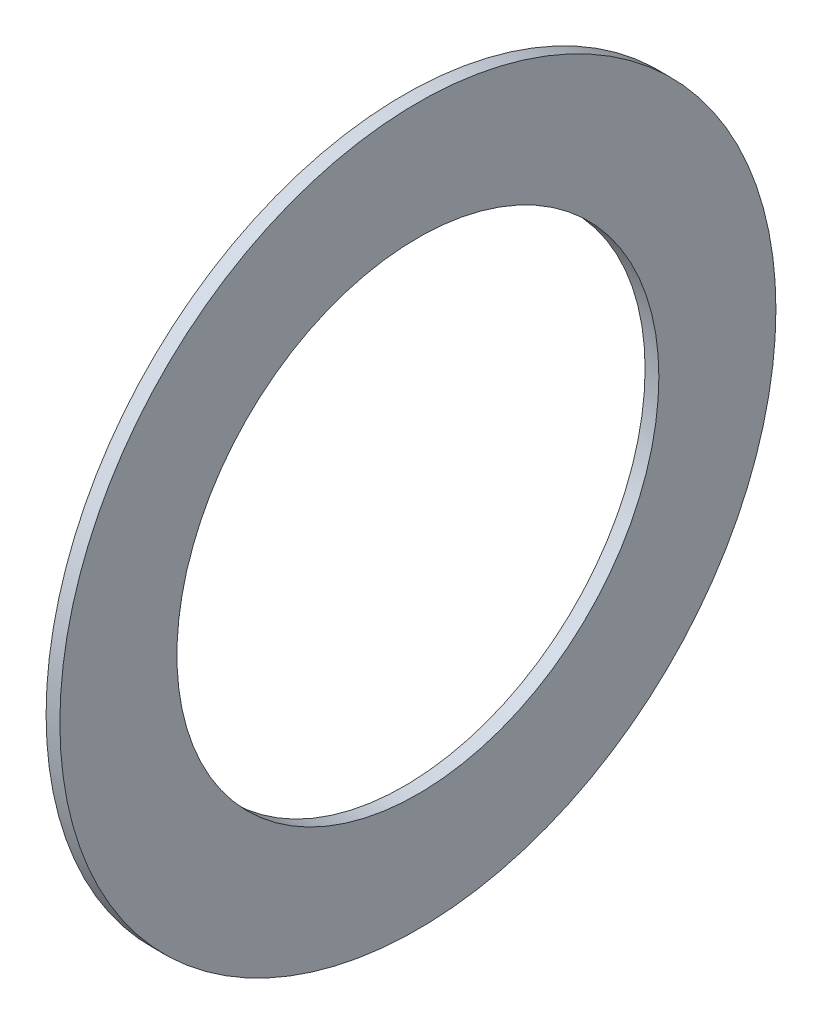
ISO-10303-21;
HEADER;
FILE_DESCRIPTION(('STEP AP214'),'2;1');
FILE_NAME('part.step','',(''),(''),'','','');
FILE_SCHEMA(('AUTOMOTIVE_DESIGN { 1 0 10303 214 1 1 1 1 }'));
ENDSEC;
DATA;
#1=APPLICATION_CONTEXT('core data for automotive mechanical design processes');
#2=APPLICATION_PROTOCOL_DEFINITION('international standard','automotive_design',2000,#1);
#3=PRODUCT_CONTEXT('',#1,'mechanical');
#4=PRODUCT('Part','Part','',(#3));
#5=PRODUCT_RELATED_PRODUCT_CATEGORY('part','',(#4));
#6=PRODUCT_DEFINITION_FORMATION('','',#4);
#7=PRODUCT_DEFINITION_CONTEXT('part definition',#1,'design');
#8=PRODUCT_DEFINITION('design','',#6,#7);
#9=PRODUCT_DEFINITION_SHAPE('','',#8);
#10=(LENGTH_UNIT() NAMED_UNIT(*) SI_UNIT(.MILLI.,.METRE.));
#11=(NAMED_UNIT(*) PLANE_ANGLE_UNIT() SI_UNIT($,.RADIAN.));
#12=(NAMED_UNIT(*) SI_UNIT($,.STERADIAN.) SOLID_ANGLE_UNIT());
#13=UNCERTAINTY_MEASURE_WITH_UNIT(LENGTH_MEASURE(1.E-05),#10,'distance_accuracy_value','');
#14=(GEOMETRIC_REPRESENTATION_CONTEXT(3) GLOBAL_UNCERTAINTY_ASSIGNED_CONTEXT((#13)) GLOBAL_UNIT_ASSIGNED_CONTEXT((#10,
#11,#12)) REPRESENTATION_CONTEXT('',''));
#15=CARTESIAN_POINT('',(0.,0.,0.));
#16=DIRECTION('',(0.,0.,1.));
#17=DIRECTION('',(1.,0.,0.));
#18=AXIS2_PLACEMENT_3D('',#15,#16,#17);
#19=CARTESIAN_POINT('',(1.,0.,0.));
#20=DIRECTION('',(1.,0.,0.));
#21=DIRECTION('',(0.,0.,-1.));
#22=AXIS2_PLACEMENT_3D('',#19,#20,#21);
#23=PLANE('',#22);
#24=CARTESIAN_POINT('',(1.,0.,0.));
#25=DIRECTION('',(1.,0.,0.));
#26=DIRECTION('',(0.,0.,-1.));
#27=AXIS2_PLACEMENT_3D('',#24,#25,#26);
#28=CIRCLE('',#27,26.);
#29=CARTESIAN_POINT('',(1.,0.,-26.));
#30=VERTEX_POINT('',#29);
#31=EDGE_CURVE('E10',#30,#30,#28,.T.);
#32=ORIENTED_EDGE('',*,*,#31,.T.);
#33=EDGE_LOOP('',(#32));
#34=FACE_BOUND('',#33,.T.);
#35=CARTESIAN_POINT('',(1.,0.,0.));
#36=DIRECTION('',(1.,0.,0.));
#37=DIRECTION('',(0.,0.,-1.));
#38=AXIS2_PLACEMENT_3D('',#35,#36,#37);
#39=CIRCLE('',#38,17.5);
#40=CARTESIAN_POINT('',(1.,0.,-17.5));
#41=VERTEX_POINT('',#40);
#42=EDGE_CURVE('E43',#41,#41,#39,.T.);
#43=ORIENTED_EDGE('',*,*,#42,.F.);
#44=EDGE_LOOP('',(#43));
#45=FACE_BOUND('',#44,.T.);
#46=ADVANCED_FACE('F32',(#34,#45),#23,.T.);
#47=CARTESIAN_POINT('',(0.,0.,0.));
#48=DIRECTION('',(1.,0.,0.));
#49=DIRECTION('',(0.,0.,-1.));
#50=AXIS2_PLACEMENT_3D('',#47,#48,#49);
#51=PLANE('',#50);
#52=CARTESIAN_POINT('',(0.,0.,0.));
#53=DIRECTION('',(1.,0.,0.));
#54=DIRECTION('',(0.,0.,-1.));
#55=AXIS2_PLACEMENT_3D('',#52,#53,#54);
#56=CIRCLE('',#55,26.);
#57=CARTESIAN_POINT('',(0.,0.,-26.));
#58=VERTEX_POINT('',#57);
#59=EDGE_CURVE('E36',#58,#58,#56,.T.);
#60=ORIENTED_EDGE('',*,*,#59,.F.);
#61=EDGE_LOOP('',(#60));
#62=FACE_BOUND('',#61,.T.);
#63=CARTESIAN_POINT('',(0.,0.,0.));
#64=DIRECTION('',(1.,0.,0.));
#65=DIRECTION('',(0.,0.,-1.));
#66=AXIS2_PLACEMENT_3D('',#63,#64,#65);
#67=CIRCLE('',#66,17.5);
#68=CARTESIAN_POINT('',(0.,0.,-17.5));
#69=VERTEX_POINT('',#68);
#70=EDGE_CURVE('E45',#69,#69,#67,.T.);
#71=ORIENTED_EDGE('',*,*,#70,.T.);
#72=EDGE_LOOP('',(#71));
#73=FACE_BOUND('',#72,.T.);
#74=ADVANCED_FACE('F55',(#62,#73),#51,.F.);
#75=CARTESIAN_POINT('',(1.,0.,0.));
#76=DIRECTION('',(-1.,0.,0.));
#77=DIRECTION('',(0.,0.,1.));
#78=AXIS2_PLACEMENT_3D('',#75,#76,#77);
#79=CYLINDRICAL_SURFACE('',#78,26.);
#80=ORIENTED_EDGE('',*,*,#31,.F.);
#81=EDGE_LOOP('',(#80));
#82=FACE_BOUND('',#81,.T.);
#83=ORIENTED_EDGE('',*,*,#59,.T.);
#84=EDGE_LOOP('',(#83));
#85=FACE_BOUND('',#84,.T.);
#86=ADVANCED_FACE('F34',(#82,#85),#79,.T.);
#87=CARTESIAN_POINT('',(1.,0.,0.));
#88=DIRECTION('',(-1.,0.,0.));
#89=DIRECTION('',(0.,0.,1.));
#90=AXIS2_PLACEMENT_3D('',#87,#88,#89);
#91=CYLINDRICAL_SURFACE('',#90,17.5);
#92=ORIENTED_EDGE('',*,*,#42,.T.);
#93=EDGE_LOOP('',(#92));
#94=FACE_BOUND('',#93,.T.);
#95=ORIENTED_EDGE('',*,*,#70,.F.);
#96=EDGE_LOOP('',(#95));
#97=FACE_BOUND('',#96,.T.);
#98=ADVANCED_FACE('F51',(#94,#97),#91,.F.);
#99=CLOSED_SHELL('',(#46,#74,#86,#98));
#100=MANIFOLD_SOLID_BREP('B2',#99);
#101=ADVANCED_BREP_SHAPE_REPRESENTATION('',(#18,#100),#14);
#102=SHAPE_DEFINITION_REPRESENTATION(#9,#101);
ENDSEC;
END-ISO-10303-21;
